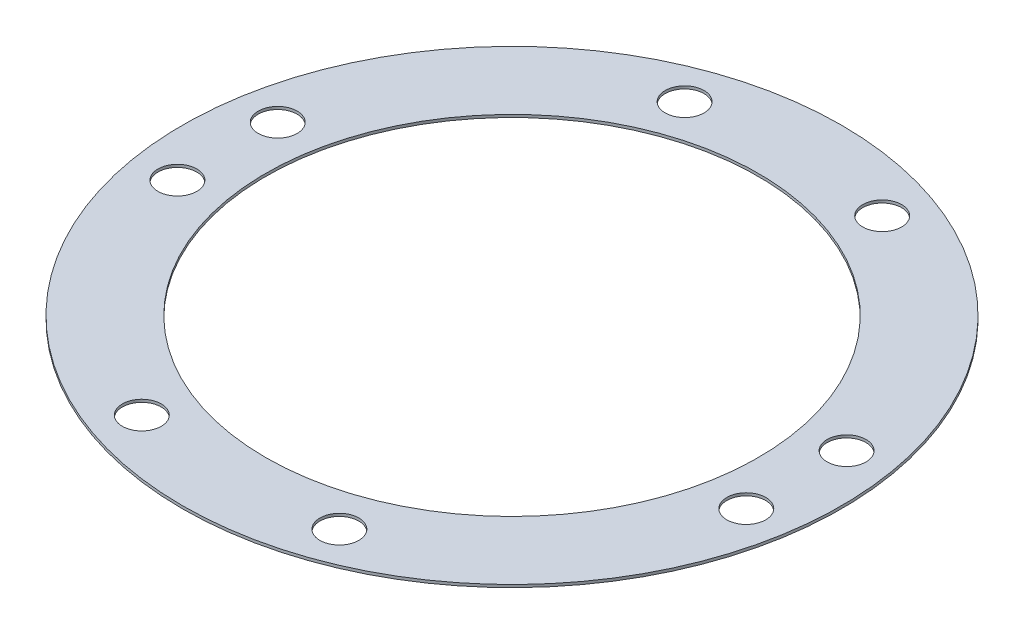
ISO-10303-21;
HEADER;
FILE_DESCRIPTION(('STEP AP214'),'2;1');
FILE_NAME('part.step','',(''),(''),'','','');
FILE_SCHEMA(('AUTOMOTIVE_DESIGN { 1 0 10303 214 1 1 1 1 }'));
ENDSEC;
DATA;
#1=APPLICATION_CONTEXT('core data for automotive mechanical design processes');
#2=APPLICATION_PROTOCOL_DEFINITION('international standard','automotive_design',2000,#1);
#3=PRODUCT_CONTEXT('',#1,'mechanical');
#4=PRODUCT('Part','Part','',(#3));
#5=PRODUCT_RELATED_PRODUCT_CATEGORY('part','',(#4));
#6=PRODUCT_DEFINITION_FORMATION('','',#4);
#7=PRODUCT_DEFINITION_CONTEXT('part definition',#1,'design');
#8=PRODUCT_DEFINITION('design','',#6,#7);
#9=PRODUCT_DEFINITION_SHAPE('','',#8);
#10=(LENGTH_UNIT() NAMED_UNIT(*) SI_UNIT(.MILLI.,.METRE.));
#11=(NAMED_UNIT(*) PLANE_ANGLE_UNIT() SI_UNIT($,.RADIAN.));
#12=(NAMED_UNIT(*) SI_UNIT($,.STERADIAN.) SOLID_ANGLE_UNIT());
#13=UNCERTAINTY_MEASURE_WITH_UNIT(LENGTH_MEASURE(1.E-05),#10,'distance_accuracy_value','');
#14=(GEOMETRIC_REPRESENTATION_CONTEXT(3) GLOBAL_UNCERTAINTY_ASSIGNED_CONTEXT((#13)) GLOBAL_UNIT_ASSIGNED_CONTEXT((#10,
#11,#12)) REPRESENTATION_CONTEXT('',''));
#15=CARTESIAN_POINT('',(0.,0.,0.));
#16=DIRECTION('',(0.,0.,1.));
#17=DIRECTION('',(1.,0.,0.));
#18=AXIS2_PLACEMENT_3D('',#15,#16,#17);
#19=CARTESIAN_POINT('',(0.,-0.7366,0.));
#20=DIRECTION('',(0.,1.,0.));
#21=DIRECTION('',(0.,0.,1.));
#22=AXIS2_PLACEMENT_3D('',#19,#20,#21);
#23=CYLINDRICAL_SURFACE('',#22,89.);
#24=CARTESIAN_POINT('',(0.,-0.7366,0.));
#25=DIRECTION('',(0.,1.,0.));
#26=DIRECTION('',(0.,0.,1.));
#27=AXIS2_PLACEMENT_3D('',#24,#25,#26);
#28=CIRCLE('',#27,89.);
#29=CARTESIAN_POINT('',(0.,-0.7366,89.));
#30=VERTEX_POINT('',#29);
#31=EDGE_CURVE('E10',#30,#30,#28,.T.);
#32=ORIENTED_EDGE('',*,*,#31,.T.);
#33=EDGE_LOOP('',(#32));
#34=FACE_BOUND('',#33,.T.);
#35=CARTESIAN_POINT('',(0.,0.,0.));
#36=DIRECTION('',(0.,1.,0.));
#37=DIRECTION('',(0.,0.,1.));
#38=AXIS2_PLACEMENT_3D('',#35,#36,#37);
#39=CIRCLE('',#38,89.);
#40=CARTESIAN_POINT('',(0.,0.,89.));
#41=VERTEX_POINT('',#40);
#42=EDGE_CURVE('E36',#41,#41,#39,.T.);
#43=ORIENTED_EDGE('',*,*,#42,.F.);
#44=EDGE_LOOP('',(#43));
#45=FACE_BOUND('',#44,.T.);
#46=ADVANCED_FACE('F33',(#34,#45),#23,.T.);
#47=CARTESIAN_POINT('',(0.,-0.7366,0.));
#48=DIRECTION('',(0.,1.,0.));
#49=DIRECTION('',(0.,0.,1.));
#50=AXIS2_PLACEMENT_3D('',#47,#48,#49);
#51=PLANE('',#50);
#52=CARTESIAN_POINT('',(76.8150047349522,-0.7366,13.5445578580206));
#53=DIRECTION('',(0.,1.,0.));
#54=DIRECTION('',(0.,0.,1.));
#55=AXIS2_PLACEMENT_3D('',#52,#53,#54);
#56=CIRCLE('',#55,5.25);
#57=CARTESIAN_POINT('',(76.8150047349522,-0.7366,18.7945578580206));
#58=VERTEX_POINT('',#57);
#59=EDGE_CURVE('E90',#58,#58,#56,.T.);
#60=ORIENTED_EDGE('',*,*,#59,.T.);
#61=EDGE_LOOP('',(#60));
#62=FACE_BOUND('',#61,.T.);
#63=CARTESIAN_POINT('',(76.8150047349522,-0.7366,-13.5445578580206));
#64=DIRECTION('',(0.,1.,0.));
#65=DIRECTION('',(0.,0.,1.));
#66=AXIS2_PLACEMENT_3D('',#63,#64,#65);
#67=CIRCLE('',#66,5.25);
#68=CARTESIAN_POINT('',(76.8150047349522,-0.7366,-8.29455785802059));
#69=VERTEX_POINT('',#68);
#70=EDGE_CURVE('E84',#69,#69,#67,.T.);
#71=ORIENTED_EDGE('',*,*,#70,.T.);
#72=EDGE_LOOP('',(#71));
#73=FACE_BOUND('',#72,.T.);
#74=CARTESIAN_POINT('',(26.6775711794017,-0.7366,73.296024421301));
#75=DIRECTION('',(0.,1.,0.));
#76=DIRECTION('',(0.,0.,1.));
#77=AXIS2_PLACEMENT_3D('',#74,#75,#76);
#78=CIRCLE('',#77,5.25);
#79=CARTESIAN_POINT('',(26.6775711794017,-0.7366,78.546024421301));
#80=VERTEX_POINT('',#79);
#81=EDGE_CURVE('E78',#80,#80,#78,.T.);
#82=ORIENTED_EDGE('',*,*,#81,.T.);
#83=EDGE_LOOP('',(#82));
#84=FACE_BOUND('',#83,.T.);
#85=CARTESIAN_POINT('',(-26.6775711794017,-0.7366,73.296024421301));
#86=DIRECTION('',(0.,1.,0.));
#87=DIRECTION('',(0.,0.,1.));
#88=AXIS2_PLACEMENT_3D('',#85,#86,#87);
#89=CIRCLE('',#88,5.25);
#90=CARTESIAN_POINT('',(-26.6775711794017,-0.7366,78.546024421301));
#91=VERTEX_POINT('',#90);
#92=EDGE_CURVE('E72',#91,#91,#89,.T.);
#93=ORIENTED_EDGE('',*,*,#92,.T.);
#94=EDGE_LOOP('',(#93));
#95=FACE_BOUND('',#94,.T.);
#96=CARTESIAN_POINT('',(-76.8150047349522,-0.7366,13.5445578580206));
#97=DIRECTION('',(0.,1.,0.));
#98=DIRECTION('',(0.,0.,1.));
#99=AXIS2_PLACEMENT_3D('',#96,#97,#98);
#100=CIRCLE('',#99,5.25);
#101=CARTESIAN_POINT('',(-76.8150047349522,-0.7366,18.7945578580206));
#102=VERTEX_POINT('',#101);
#103=EDGE_CURVE('E66',#102,#102,#100,.T.);
#104=ORIENTED_EDGE('',*,*,#103,.T.);
#105=EDGE_LOOP('',(#104));
#106=FACE_BOUND('',#105,.T.);
#107=CARTESIAN_POINT('',(-76.8150047349522,-0.7366,-13.5445578580206));
#108=DIRECTION('',(0.,1.,0.));
#109=DIRECTION('',(0.,0.,1.));
#110=AXIS2_PLACEMENT_3D('',#107,#108,#109);
#111=CIRCLE('',#110,5.25);
#112=CARTESIAN_POINT('',(-76.8150047349522,-0.7366,-8.29455785802059));
#113=VERTEX_POINT('',#112);
#114=EDGE_CURVE('E60',#113,#113,#111,.T.);
#115=ORIENTED_EDGE('',*,*,#114,.T.);
#116=EDGE_LOOP('',(#115));
#117=FACE_BOUND('',#116,.T.);
#118=CARTESIAN_POINT('',(-26.6775711794017,-0.7366,-73.296024421301));
#119=DIRECTION('',(0.,1.,0.));
#120=DIRECTION('',(0.,0.,1.));
#121=AXIS2_PLACEMENT_3D('',#118,#119,#120);
#122=CIRCLE('',#121,5.25);
#123=CARTESIAN_POINT('',(-26.6775711794017,-0.7366,-68.046024421301));
#124=VERTEX_POINT('',#123);
#125=EDGE_CURVE('E54',#124,#124,#122,.T.);
#126=ORIENTED_EDGE('',*,*,#125,.T.);
#127=EDGE_LOOP('',(#126));
#128=FACE_BOUND('',#127,.T.);
#129=CARTESIAN_POINT('',(26.6775711794017,-0.7366,-73.296024421301));
#130=DIRECTION('',(0.,1.,0.));
#131=DIRECTION('',(0.,0.,1.));
#132=AXIS2_PLACEMENT_3D('',#129,#130,#131);
#133=CIRCLE('',#132,5.25);
#134=CARTESIAN_POINT('',(26.6775711794017,-0.7366,-68.046024421301));
#135=VERTEX_POINT('',#134);
#136=EDGE_CURVE('E48',#135,#135,#133,.T.);
#137=ORIENTED_EDGE('',*,*,#136,.T.);
#138=EDGE_LOOP('',(#137));
#139=FACE_BOUND('',#138,.T.);
#140=CARTESIAN_POINT('',(0.,-0.7366,0.));
#141=DIRECTION('',(0.,1.,0.));
#142=DIRECTION('',(0.,0.,1.));
#143=AXIS2_PLACEMENT_3D('',#140,#141,#142);
#144=CIRCLE('',#143,66.5);
#145=CARTESIAN_POINT('',(0.,-0.7366,66.5));
#146=VERTEX_POINT('',#145);
#147=EDGE_CURVE('E43',#146,#146,#144,.T.);
#148=ORIENTED_EDGE('',*,*,#147,.T.);
#149=EDGE_LOOP('',(#148));
#150=FACE_BOUND('',#149,.T.);
#151=ORIENTED_EDGE('',*,*,#31,.F.);
#152=EDGE_LOOP('',(#151));
#153=FACE_BOUND('',#152,.T.);
#154=ADVANCED_FACE('F99',(#62,#73,#84,#95,#106,#117,#128,#139,#150,#153),#51,.F.);
#155=CARTESIAN_POINT('',(0.,0.,0.));
#156=DIRECTION('',(0.,1.,0.));
#157=DIRECTION('',(0.,0.,1.));
#158=AXIS2_PLACEMENT_3D('',#155,#156,#157);
#159=PLANE('',#158);
#160=CARTESIAN_POINT('',(76.8150047349522,0.,13.5445578580206));
#161=DIRECTION('',(0.,1.,0.));
#162=DIRECTION('',(0.,0.,1.));
#163=AXIS2_PLACEMENT_3D('',#160,#161,#162);
#164=CIRCLE('',#163,5.25);
#165=CARTESIAN_POINT('',(76.8150047349522,0.,18.7945578580206));
#166=VERTEX_POINT('',#165);
#167=EDGE_CURVE('E93',#166,#166,#164,.T.);
#168=ORIENTED_EDGE('',*,*,#167,.F.);
#169=EDGE_LOOP('',(#168));
#170=FACE_BOUND('',#169,.T.);
#171=CARTESIAN_POINT('',(76.8150047349522,0.,-13.5445578580206));
#172=DIRECTION('',(0.,1.,0.));
#173=DIRECTION('',(0.,0.,1.));
#174=AXIS2_PLACEMENT_3D('',#171,#172,#173);
#175=CIRCLE('',#174,5.25);
#176=CARTESIAN_POINT('',(76.8150047349522,0.,-8.29455785802059));
#177=VERTEX_POINT('',#176);
#178=EDGE_CURVE('E87',#177,#177,#175,.T.);
#179=ORIENTED_EDGE('',*,*,#178,.F.);
#180=EDGE_LOOP('',(#179));
#181=FACE_BOUND('',#180,.T.);
#182=CARTESIAN_POINT('',(26.6775711794017,0.,73.296024421301));
#183=DIRECTION('',(0.,1.,0.));
#184=DIRECTION('',(0.,0.,1.));
#185=AXIS2_PLACEMENT_3D('',#182,#183,#184);
#186=CIRCLE('',#185,5.25);
#187=CARTESIAN_POINT('',(26.6775711794017,0.,78.546024421301));
#188=VERTEX_POINT('',#187);
#189=EDGE_CURVE('E81',#188,#188,#186,.T.);
#190=ORIENTED_EDGE('',*,*,#189,.F.);
#191=EDGE_LOOP('',(#190));
#192=FACE_BOUND('',#191,.T.);
#193=CARTESIAN_POINT('',(-26.6775711794017,0.,73.296024421301));
#194=DIRECTION('',(0.,1.,0.));
#195=DIRECTION('',(0.,0.,1.));
#196=AXIS2_PLACEMENT_3D('',#193,#194,#195);
#197=CIRCLE('',#196,5.25);
#198=CARTESIAN_POINT('',(-26.6775711794017,0.,78.546024421301));
#199=VERTEX_POINT('',#198);
#200=EDGE_CURVE('E75',#199,#199,#197,.T.);
#201=ORIENTED_EDGE('',*,*,#200,.F.);
#202=EDGE_LOOP('',(#201));
#203=FACE_BOUND('',#202,.T.);
#204=CARTESIAN_POINT('',(-76.8150047349522,0.,13.5445578580206));
#205=DIRECTION('',(0.,1.,0.));
#206=DIRECTION('',(0.,0.,1.));
#207=AXIS2_PLACEMENT_3D('',#204,#205,#206);
#208=CIRCLE('',#207,5.25);
#209=CARTESIAN_POINT('',(-76.8150047349522,0.,18.7945578580206));
#210=VERTEX_POINT('',#209);
#211=EDGE_CURVE('E69',#210,#210,#208,.T.);
#212=ORIENTED_EDGE('',*,*,#211,.F.);
#213=EDGE_LOOP('',(#212));
#214=FACE_BOUND('',#213,.T.);
#215=CARTESIAN_POINT('',(-76.8150047349522,0.,-13.5445578580206));
#216=DIRECTION('',(0.,1.,0.));
#217=DIRECTION('',(0.,0.,1.));
#218=AXIS2_PLACEMENT_3D('',#215,#216,#217);
#219=CIRCLE('',#218,5.25);
#220=CARTESIAN_POINT('',(-76.8150047349522,0.,-8.29455785802059));
#221=VERTEX_POINT('',#220);
#222=EDGE_CURVE('E63',#221,#221,#219,.T.);
#223=ORIENTED_EDGE('',*,*,#222,.F.);
#224=EDGE_LOOP('',(#223));
#225=FACE_BOUND('',#224,.T.);
#226=CARTESIAN_POINT('',(-26.6775711794017,0.,-73.296024421301));
#227=DIRECTION('',(0.,1.,0.));
#228=DIRECTION('',(0.,0.,1.));
#229=AXIS2_PLACEMENT_3D('',#226,#227,#228);
#230=CIRCLE('',#229,5.25);
#231=CARTESIAN_POINT('',(-26.6775711794017,0.,-68.046024421301));
#232=VERTEX_POINT('',#231);
#233=EDGE_CURVE('E57',#232,#232,#230,.T.);
#234=ORIENTED_EDGE('',*,*,#233,.F.);
#235=EDGE_LOOP('',(#234));
#236=FACE_BOUND('',#235,.T.);
#237=CARTESIAN_POINT('',(26.6775711794017,0.,-73.296024421301));
#238=DIRECTION('',(0.,1.,0.));
#239=DIRECTION('',(0.,0.,1.));
#240=AXIS2_PLACEMENT_3D('',#237,#238,#239);
#241=CIRCLE('',#240,5.25);
#242=CARTESIAN_POINT('',(26.6775711794017,0.,-68.046024421301));
#243=VERTEX_POINT('',#242);
#244=EDGE_CURVE('E51',#243,#243,#241,.T.);
#245=ORIENTED_EDGE('',*,*,#244,.F.);
#246=EDGE_LOOP('',(#245));
#247=FACE_BOUND('',#246,.T.);
#248=CARTESIAN_POINT('',(0.,0.,0.));
#249=DIRECTION('',(0.,1.,0.));
#250=DIRECTION('',(0.,0.,1.));
#251=AXIS2_PLACEMENT_3D('',#248,#249,#250);
#252=CIRCLE('',#251,66.5);
#253=CARTESIAN_POINT('',(0.,0.,66.5));
#254=VERTEX_POINT('',#253);
#255=EDGE_CURVE('E45',#254,#254,#252,.T.);
#256=ORIENTED_EDGE('',*,*,#255,.F.);
#257=EDGE_LOOP('',(#256));
#258=FACE_BOUND('',#257,.T.);
#259=ORIENTED_EDGE('',*,*,#42,.T.);
#260=EDGE_LOOP('',(#259));
#261=FACE_BOUND('',#260,.T.);
#262=ADVANCED_FACE('F109',(#170,#181,#192,#203,#214,#225,#236,#247,#258,#261),#159,.T.);
#263=CARTESIAN_POINT('',(0.,-0.7366,0.));
#264=DIRECTION('',(0.,1.,0.));
#265=DIRECTION('',(0.,0.,1.));
#266=AXIS2_PLACEMENT_3D('',#263,#264,#265);
#267=CYLINDRICAL_SURFACE('',#266,66.5);
#268=ORIENTED_EDGE('',*,*,#147,.F.);
#269=EDGE_LOOP('',(#268));
#270=FACE_BOUND('',#269,.T.);
#271=ORIENTED_EDGE('',*,*,#255,.T.);
#272=EDGE_LOOP('',(#271));
#273=FACE_BOUND('',#272,.T.);
#274=ADVANCED_FACE('F112',(#270,#273),#267,.F.);
#275=CARTESIAN_POINT('',(26.6775711794017,-0.7366,-73.296024421301));
#276=DIRECTION('',(0.,1.,0.));
#277=DIRECTION('',(0.,0.,1.));
#278=AXIS2_PLACEMENT_3D('',#275,#276,#277);
#279=CYLINDRICAL_SURFACE('',#278,5.25);
#280=ORIENTED_EDGE('',*,*,#136,.F.);
#281=EDGE_LOOP('',(#280));
#282=FACE_BOUND('',#281,.T.);
#283=ORIENTED_EDGE('',*,*,#244,.T.);
#284=EDGE_LOOP('',(#283));
#285=FACE_BOUND('',#284,.T.);
#286=ADVANCED_FACE('F141',(#282,#285),#279,.F.);
#287=CARTESIAN_POINT('',(-26.6775711794017,-0.7366,-73.296024421301));
#288=DIRECTION('',(0.,1.,0.));
#289=DIRECTION('',(0.,0.,1.));
#290=AXIS2_PLACEMENT_3D('',#287,#288,#289);
#291=CYLINDRICAL_SURFACE('',#290,5.25);
#292=ORIENTED_EDGE('',*,*,#125,.F.);
#293=EDGE_LOOP('',(#292));
#294=FACE_BOUND('',#293,.T.);
#295=ORIENTED_EDGE('',*,*,#233,.T.);
#296=EDGE_LOOP('',(#295));
#297=FACE_BOUND('',#296,.T.);
#298=ADVANCED_FACE('F145',(#294,#297),#291,.F.);
#299=CARTESIAN_POINT('',(-76.8150047349522,-0.7366,-13.5445578580206));
#300=DIRECTION('',(0.,1.,0.));
#301=DIRECTION('',(0.,0.,1.));
#302=AXIS2_PLACEMENT_3D('',#299,#300,#301);
#303=CYLINDRICAL_SURFACE('',#302,5.25);
#304=ORIENTED_EDGE('',*,*,#114,.F.);
#305=EDGE_LOOP('',(#304));
#306=FACE_BOUND('',#305,.T.);
#307=ORIENTED_EDGE('',*,*,#222,.T.);
#308=EDGE_LOOP('',(#307));
#309=FACE_BOUND('',#308,.T.);
#310=ADVANCED_FACE('F149',(#306,#309),#303,.F.);
#311=CARTESIAN_POINT('',(-76.8150047349522,-0.7366,13.5445578580206));
#312=DIRECTION('',(0.,1.,0.));
#313=DIRECTION('',(0.,0.,1.));
#314=AXIS2_PLACEMENT_3D('',#311,#312,#313);
#315=CYLINDRICAL_SURFACE('',#314,5.25);
#316=ORIENTED_EDGE('',*,*,#103,.F.);
#317=EDGE_LOOP('',(#316));
#318=FACE_BOUND('',#317,.T.);
#319=ORIENTED_EDGE('',*,*,#211,.T.);
#320=EDGE_LOOP('',(#319));
#321=FACE_BOUND('',#320,.T.);
#322=ADVANCED_FACE('F153',(#318,#321),#315,.F.);
#323=CARTESIAN_POINT('',(-26.6775711794017,-0.7366,73.296024421301));
#324=DIRECTION('',(0.,1.,0.));
#325=DIRECTION('',(0.,0.,1.));
#326=AXIS2_PLACEMENT_3D('',#323,#324,#325);
#327=CYLINDRICAL_SURFACE('',#326,5.25);
#328=ORIENTED_EDGE('',*,*,#92,.F.);
#329=EDGE_LOOP('',(#328));
#330=FACE_BOUND('',#329,.T.);
#331=ORIENTED_EDGE('',*,*,#200,.T.);
#332=EDGE_LOOP('',(#331));
#333=FACE_BOUND('',#332,.T.);
#334=ADVANCED_FACE('F157',(#330,#333),#327,.F.);
#335=CARTESIAN_POINT('',(26.6775711794017,-0.7366,73.296024421301));
#336=DIRECTION('',(0.,1.,0.));
#337=DIRECTION('',(0.,0.,1.));
#338=AXIS2_PLACEMENT_3D('',#335,#336,#337);
#339=CYLINDRICAL_SURFACE('',#338,5.25);
#340=ORIENTED_EDGE('',*,*,#81,.F.);
#341=EDGE_LOOP('',(#340));
#342=FACE_BOUND('',#341,.T.);
#343=ORIENTED_EDGE('',*,*,#189,.T.);
#344=EDGE_LOOP('',(#343));
#345=FACE_BOUND('',#344,.T.);
#346=ADVANCED_FACE('F161',(#342,#345),#339,.F.);
#347=CARTESIAN_POINT('',(76.8150047349522,-0.7366,-13.5445578580206));
#348=DIRECTION('',(0.,1.,0.));
#349=DIRECTION('',(0.,0.,1.));
#350=AXIS2_PLACEMENT_3D('',#347,#348,#349);
#351=CYLINDRICAL_SURFACE('',#350,5.25);
#352=ORIENTED_EDGE('',*,*,#70,.F.);
#353=EDGE_LOOP('',(#352));
#354=FACE_BOUND('',#353,.T.);
#355=ORIENTED_EDGE('',*,*,#178,.T.);
#356=EDGE_LOOP('',(#355));
#357=FACE_BOUND('',#356,.T.);
#358=ADVANCED_FACE('F105',(#354,#357),#351,.F.);
#359=CARTESIAN_POINT('',(76.8150047349522,-0.7366,13.5445578580206));
#360=DIRECTION('',(0.,1.,0.));
#361=DIRECTION('',(0.,0.,1.));
#362=AXIS2_PLACEMENT_3D('',#359,#360,#361);
#363=CYLINDRICAL_SURFACE('',#362,5.25);
#364=ORIENTED_EDGE('',*,*,#59,.F.);
#365=EDGE_LOOP('',(#364));
#366=FACE_BOUND('',#365,.T.);
#367=ORIENTED_EDGE('',*,*,#167,.T.);
#368=EDGE_LOOP('',(#367));
#369=FACE_BOUND('',#368,.T.);
#370=ADVANCED_FACE('F102',(#366,#369),#363,.F.);
#371=CLOSED_SHELL('',(#46,#154,#262,#274,#286,#298,#310,#322,#334,#346,#358,#370));
#372=MANIFOLD_SOLID_BREP('B2',#371);
#373=ADVANCED_BREP_SHAPE_REPRESENTATION('',(#18,#372),#14);
#374=SHAPE_DEFINITION_REPRESENTATION(#9,#373);
ENDSEC;
END-ISO-10303-21;
